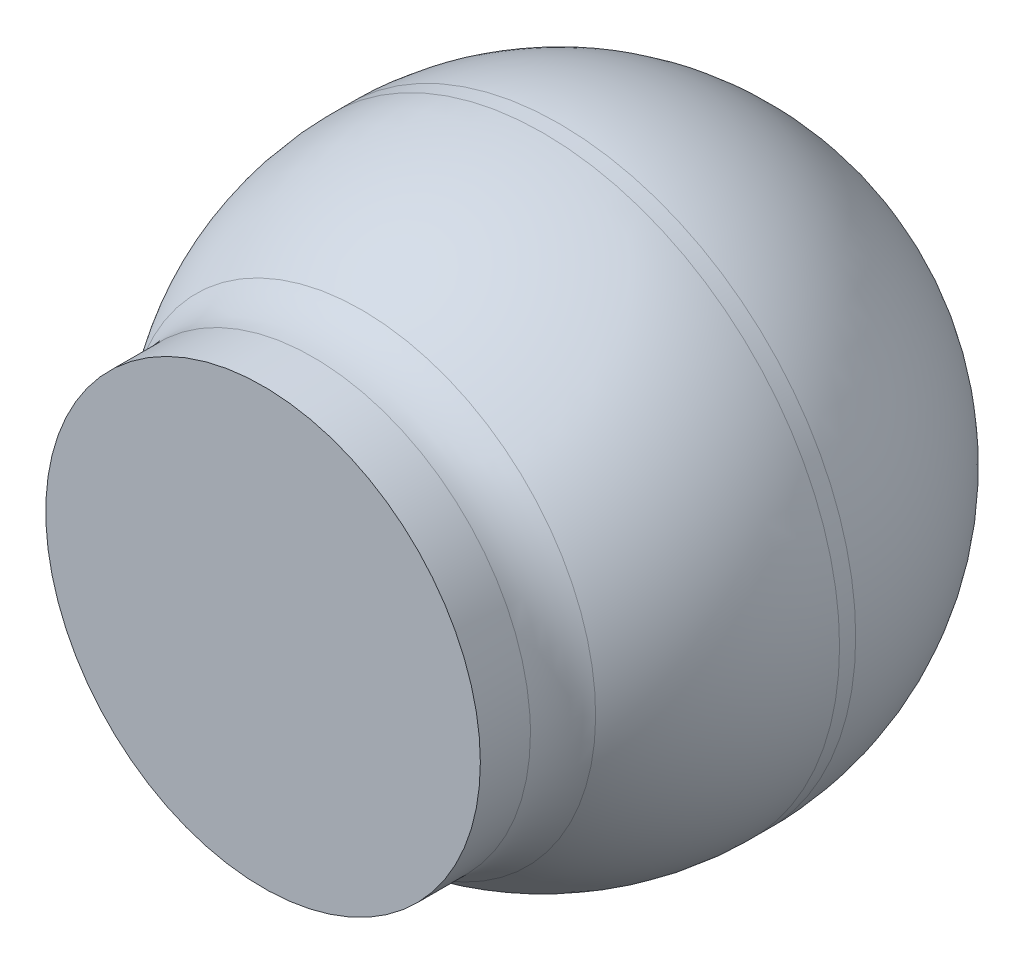
ISO-10303-21;
HEADER;
FILE_DESCRIPTION(('STEP AP214'),'2;1');
FILE_NAME('part.step','',(''),(''),'','','');
FILE_SCHEMA(('AUTOMOTIVE_DESIGN { 1 0 10303 214 1 1 1 1 }'));
ENDSEC;
DATA;
#1=APPLICATION_CONTEXT('core data for automotive mechanical design processes');
#2=APPLICATION_PROTOCOL_DEFINITION('international standard','automotive_design',2000,#1);
#3=PRODUCT_CONTEXT('',#1,'mechanical');
#4=PRODUCT('Part','Part','',(#3));
#5=PRODUCT_RELATED_PRODUCT_CATEGORY('part','',(#4));
#6=PRODUCT_DEFINITION_FORMATION('','',#4);
#7=PRODUCT_DEFINITION_CONTEXT('part definition',#1,'design');
#8=PRODUCT_DEFINITION('design','',#6,#7);
#9=PRODUCT_DEFINITION_SHAPE('','',#8);
#10=(LENGTH_UNIT() NAMED_UNIT(*) SI_UNIT(.MILLI.,.METRE.));
#11=(NAMED_UNIT(*) PLANE_ANGLE_UNIT() SI_UNIT($,.RADIAN.));
#12=(NAMED_UNIT(*) SI_UNIT($,.STERADIAN.) SOLID_ANGLE_UNIT());
#13=UNCERTAINTY_MEASURE_WITH_UNIT(LENGTH_MEASURE(1.E-05),#10,'distance_accuracy_value','');
#14=(GEOMETRIC_REPRESENTATION_CONTEXT(3) GLOBAL_UNCERTAINTY_ASSIGNED_CONTEXT((#13)) GLOBAL_UNIT_ASSIGNED_CONTEXT((#10,
#11,#12)) REPRESENTATION_CONTEXT('',''));
#15=CARTESIAN_POINT('',(0.,0.,0.));
#16=DIRECTION('',(0.,0.,1.));
#17=DIRECTION('',(1.,0.,0.));
#18=AXIS2_PLACEMENT_3D('',#15,#16,#17);
#19=CARTESIAN_POINT('',(-9.452919922269,-5.321349291452,10.006534503384));
#20=DIRECTION('',(0.,0.,-1.));
#21=DIRECTION('',(-1.,0.,0.));
#22=AXIS2_PLACEMENT_3D('',#19,#20,#21);
#23=PLANE('',#22);
#24=CARTESIAN_POINT('',(-9.452919922269,-5.321349291452,10.006534503384));
#25=DIRECTION('',(0.,0.,1.));
#26=DIRECTION('',(1.,0.,0.));
#27=AXIS2_PLACEMENT_3D('',#24,#25,#26);
#28=CIRCLE('',#27,0.275);
#29=CARTESIAN_POINT('',(-9.177919922269,-5.321349291452,10.006534503384));
#30=VERTEX_POINT('',#29);
#31=EDGE_CURVE('E20',#30,#30,#28,.F.);
#32=ORIENTED_EDGE('',*,*,#31,.F.);
#33=EDGE_LOOP('',(#32));
#34=FACE_BOUND('',#33,.T.);
#35=ADVANCED_FACE('F17',(#34),#23,.F.);
#36=CARTESIAN_POINT('',(-9.452919922269,-5.321349291452,9.906534503384));
#37=DIRECTION('',(0.,0.,1.));
#38=DIRECTION('',(1.,0.,0.));
#39=AXIS2_PLACEMENT_3D('',#36,#37,#38);
#40=CYLINDRICAL_SURFACE('',#39,0.275);
#41=CARTESIAN_POINT('',(-9.452919922269,-5.321349291452,9.943180457728));
#42=DIRECTION('',(0.,0.,-1.));
#43=DIRECTION('',(0.996700902337583,0.0811622527992436,0.));
#44=AXIS2_PLACEMENT_3D('',#41,#42,#43);
#45=CIRCLE('',#44,0.275000000000001);
#46=CARTESIAN_POINT('',(-9.17882717412617,-5.29902967193221,9.943180457728));
#47=VERTEX_POINT('',#46);
#48=EDGE_CURVE('E65',#47,#47,#45,.F.);
#49=ORIENTED_EDGE('',*,*,#48,.T.);
#50=EDGE_LOOP('',(#49));
#51=FACE_BOUND('',#50,.T.);
#52=ORIENTED_EDGE('',*,*,#31,.T.);
#53=EDGE_LOOP('',(#52));
#54=FACE_BOUND('',#53,.T.);
#55=ADVANCED_FACE('F62',(#51,#54),#40,.T.);
#56=CARTESIAN_POINT('',(-9.452919922269,-5.321349291452,9.943180457728));
#57=DIRECTION('',(0.,0.,-1.));
#58=DIRECTION('',(0.996700902337583,0.0811622527992448,0.));
#59=AXIS2_PLACEMENT_3D('',#56,#57,#58);
#60=TOROIDAL_SURFACE('',#59,0.375,0.1);
#61=ORIENTED_EDGE('',*,*,#48,.F.);
#62=EDGE_LOOP('',(#61));
#63=FACE_BOUND('',#62,.T.);
#64=CARTESIAN_POINT('',(-9.452919922269,-5.321349291452,9.881744931236));
#65=DIRECTION('',(0.,0.,-1.));
#66=DIRECTION('',(-0.996700902337597,-0.0811622527990627,0.));
#67=AXIS2_PLACEMENT_3D('',#64,#65,#66);
#68=CIRCLE('',#67,0.296097046412663);
#69=CARTESIAN_POINT('',(-9.748040115608,-5.345381194786,9.881744931236));
#70=VERTEX_POINT('',#69);
#71=EDGE_CURVE('E39',#70,#70,#68,.T.);
#72=ORIENTED_EDGE('',*,*,#71,.F.);
#73=EDGE_LOOP('',(#72));
#74=FACE_BOUND('',#73,.T.);
#75=ADVANCED_FACE('F57',(#63,#74),#60,.F.);
#76=CARTESIAN_POINT('',(-9.826682760645,-5.351785136252,9.651976062157));
#77=CARTESIAN_POINT('',(-9.826682760645,-5.351785136252,9.701461392103));
#78=CARTESIAN_POINT('',(-9.818526217348,-5.351120941579,9.750947004335));
#79=CARTESIAN_POINT('',(-9.802207085349,-5.349792059952,9.798626332798));
#80=CARTESIAN_POINT('',(-9.778341390838,-5.347848654938,9.842699544317));
#81=CARTESIAN_POINT('',(-9.748040115608,-5.345381194786,9.881744931236));
#82=(BOUNDED_CURVE() B_SPLINE_CURVE(5,(#76,#77,#78,#79,#80,#81),.UNSPECIFIED.,.F.,
.F.) B_SPLINE_CURVE_WITH_KNOTS((6,6),(0.,0.661568582165),
.UNSPECIFIED.) CURVE() GEOMETRIC_REPRESENTATION_ITEM() RATIONAL_B_SPLINE_CURVE((1.,1.,1.,1.,1.,1.)) REPRESENTATION_ITEM(''));
#83=CARTESIAN_POINT('',(-9.452919922269,-5.321349291452,9.651976062157));
#84=DIRECTION('',(0.,0.,-1.));
#85=AXIS1_PLACEMENT('',#83,#84);
#86=SURFACE_OF_REVOLUTION('',#82,#85);
#87=CARTESIAN_POINT('',(-9.452919922269,-5.321349291452,9.651976062157));
#88=DIRECTION('',(0.,0.,1.));
#89=DIRECTION('',(1.,0.,0.));
#90=AXIS2_PLACEMENT_3D('',#87,#88,#89);
#91=CIRCLE('',#90,0.375);
#92=CARTESIAN_POINT('',(-9.077919922269,-5.321349291452,9.651976062157));
#93=VERTEX_POINT('',#92);
#94=EDGE_CURVE('E36',#93,#93,#91,.F.);
#95=ORIENTED_EDGE('',*,*,#94,.F.);
#96=EDGE_LOOP('',(#95));
#97=FACE_BOUND('',#96,.T.);
#98=ORIENTED_EDGE('',*,*,#71,.T.);
#99=EDGE_LOOP('',(#98));
#100=FACE_BOUND('',#99,.T.);
#101=ADVANCED_FACE('F53',(#97,#100),#86,.F.);
#102=CARTESIAN_POINT('',(-9.452919922269,-5.321349291452,9.256534503384));
#103=DIRECTION('',(0.,0.,1.));
#104=DIRECTION('',(1.,0.,0.));
#105=AXIS2_PLACEMENT_3D('',#102,#103,#104);
#106=CYLINDRICAL_SURFACE('',#105,0.375);
#107=CARTESIAN_POINT('',(-9.452919922269,-5.321349291452,9.631534503384));
#108=DIRECTION('',(0.,0.,-1.));
#109=DIRECTION('',(0.0811622527992357,-0.996700902337583,0.));
#110=AXIS2_PLACEMENT_3D('',#107,#108,#109);
#111=CIRCLE('',#110,0.375);
#112=CARTESIAN_POINT('',(-9.42248407746929,-5.69511212982859,9.631534503384));
#113=VERTEX_POINT('',#112);
#114=CARTESIAN_POINT('',(-9.48335576706871,-4.94758645307541,9.631534503384));
#115=VERTEX_POINT('',#114);
#116=EDGE_CURVE('E11',#113,#115,#111,.T.);
#117=ORIENTED_EDGE('',*,*,#116,.F.);
#118=CARTESIAN_POINT('',(-9.452919922269,-5.321349291452,9.631534503384));
#119=DIRECTION('',(0.,0.,1.));
#120=DIRECTION('',(0.0811622527992365,-0.996700902337583,0.));
#121=AXIS2_PLACEMENT_3D('',#118,#119,#120);
#122=CIRCLE('',#121,0.375);
#123=EDGE_CURVE('E25',#115,#113,#122,.F.);
#124=ORIENTED_EDGE('',*,*,#123,.F.);
#125=EDGE_LOOP('',(#117,#124));
#126=FACE_BOUND('',#125,.T.);
#127=ORIENTED_EDGE('',*,*,#94,.T.);
#128=EDGE_LOOP('',(#127));
#129=FACE_BOUND('',#128,.T.);
#130=ADVANCED_FACE('F34',(#126,#129),#106,.T.);
#131=CARTESIAN_POINT('',(-9.452919922269,-5.321349291452,9.631534503384));
#132=DIRECTION('',(0.0811622527992361,-0.996700902337583,0.));
#133=DIRECTION('',(-0.996700902337583,-0.0811622527992361,0.));
#134=AXIS2_PLACEMENT_3D('',#131,#132,#133);
#135=SPHERICAL_SURFACE('',#134,0.375);
#136=ORIENTED_EDGE('',*,*,#123,.T.);
#137=ORIENTED_EDGE('',*,*,#116,.T.);
#138=EDGE_LOOP('',(#136,#137));
#139=FACE_BOUND('',#138,.T.);
#140=ADVANCED_FACE('F32',(#139),#135,.T.);
#141=CLOSED_SHELL('',(#35,#55,#75,#101,#130,#140));
#142=MANIFOLD_SOLID_BREP('B1',#141);
#143=ADVANCED_BREP_SHAPE_REPRESENTATION('',(#18,#142),#14);
#144=SHAPE_DEFINITION_REPRESENTATION(#9,#143);
ENDSEC;
END-ISO-10303-21;
